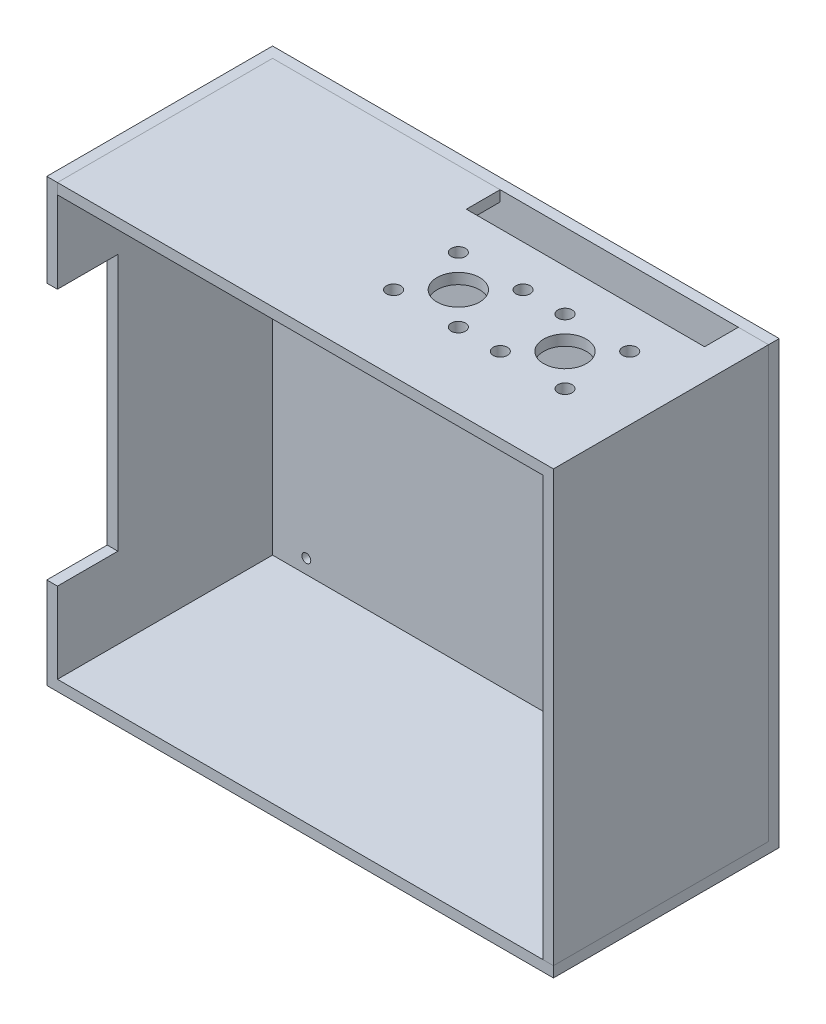
ISO-10303-21;
HEADER;
FILE_DESCRIPTION(('STEP AP214'),'2;1');
FILE_NAME('part.step','',(''),(''),'','','');
FILE_SCHEMA(('AUTOMOTIVE_DESIGN { 1 0 10303 214 1 1 1 1 }'));
ENDSEC;
DATA;
#1=APPLICATION_CONTEXT('core data for automotive mechanical design processes');
#2=APPLICATION_PROTOCOL_DEFINITION('international standard','automotive_design',2000,#1);
#3=PRODUCT_CONTEXT('',#1,'mechanical');
#4=PRODUCT('Part','Part','',(#3));
#5=PRODUCT_RELATED_PRODUCT_CATEGORY('part','',(#4));
#6=PRODUCT_DEFINITION_FORMATION('','',#4);
#7=PRODUCT_DEFINITION_CONTEXT('part definition',#1,'design');
#8=PRODUCT_DEFINITION('design','',#6,#7);
#9=PRODUCT_DEFINITION_SHAPE('','',#8);
#10=(LENGTH_UNIT() NAMED_UNIT(*) SI_UNIT(.MILLI.,.METRE.));
#11=(NAMED_UNIT(*) PLANE_ANGLE_UNIT() SI_UNIT($,.RADIAN.));
#12=(NAMED_UNIT(*) SI_UNIT($,.STERADIAN.) SOLID_ANGLE_UNIT());
#13=UNCERTAINTY_MEASURE_WITH_UNIT(LENGTH_MEASURE(1.E-05),#10,'distance_accuracy_value','');
#14=(GEOMETRIC_REPRESENTATION_CONTEXT(3) GLOBAL_UNCERTAINTY_ASSIGNED_CONTEXT((#13)) GLOBAL_UNIT_ASSIGNED_CONTEXT((#10,
#11,#12)) REPRESENTATION_CONTEXT('',''));
#15=CARTESIAN_POINT('',(0.,0.,0.));
#16=DIRECTION('',(0.,0.,1.));
#17=DIRECTION('',(1.,0.,0.));
#18=AXIS2_PLACEMENT_3D('',#15,#16,#17);
#19=CARTESIAN_POINT('',(68.25,0.,-28.75));
#20=DIRECTION('',(0.,0.,1.));
#21=DIRECTION('',(1.,0.,0.));
#22=AXIS2_PLACEMENT_3D('',#19,#20,#21);
#23=PLANE('',#22);
#24=DIRECTION('',(0.,-1.,0.));
#25=VECTOR('',#24,1.);
#26=CARTESIAN_POINT('',(71.25,0.,-28.75));
#27=LINE('',#26,#25);
#28=CARTESIAN_POINT('',(71.25,124.,-28.75));
#29=VERTEX_POINT('',#28);
#30=CARTESIAN_POINT('',(71.25,3.,-28.75));
#31=VERTEX_POINT('',#30);
#32=EDGE_CURVE('E134',#29,#31,#27,.T.);
#33=ORIENTED_EDGE('',*,*,#32,.T.);
#34=DIRECTION('',(1.,0.,0.));
#35=VECTOR('',#34,1.);
#36=CARTESIAN_POINT('',(68.25,3.,-28.75));
#37=LINE('',#36,#35);
#38=CARTESIAN_POINT('',(68.25,3.,-28.75));
#39=VERTEX_POINT('',#38);
#40=EDGE_CURVE('E12',#39,#31,#37,.T.);
#41=ORIENTED_EDGE('',*,*,#40,.F.);
#42=DIRECTION('',(0.,-1.,0.));
#43=VECTOR('',#42,1.);
#44=CARTESIAN_POINT('',(68.25,0.,-28.75));
#45=LINE('',#44,#43);
#46=CARTESIAN_POINT('',(68.25,121.,-28.75));
#47=VERTEX_POINT('',#46);
#48=EDGE_CURVE('E72',#47,#39,#45,.T.);
#49=ORIENTED_EDGE('',*,*,#48,.F.);
#50=DIRECTION('',(1.,0.,0.));
#51=VECTOR('',#50,1.);
#52=CARTESIAN_POINT('',(0.,121.,-28.75));
#53=LINE('',#52,#51);
#54=CARTESIAN_POINT('',(62.75,121.,-28.75));
#55=VERTEX_POINT('',#54);
#56=EDGE_CURVE('E99',#55,#47,#53,.T.);
#57=ORIENTED_EDGE('',*,*,#56,.F.);
#58=DIRECTION('',(0.,1.,0.));
#59=VECTOR('',#58,1.);
#60=CARTESIAN_POINT('',(62.75,121.,-28.75));
#61=LINE('',#60,#59);
#62=CARTESIAN_POINT('',(62.75,124.,-28.75));
#63=VERTEX_POINT('',#62);
#64=EDGE_CURVE('E205',#55,#63,#61,.T.);
#65=ORIENTED_EDGE('',*,*,#64,.T.);
#66=DIRECTION('',(1.,0.,0.));
#67=VECTOR('',#66,1.);
#68=CARTESIAN_POINT('',(0.,124.,-28.75));
#69=LINE('',#68,#67);
#70=EDGE_CURVE('E154',#63,#29,#69,.T.);
#71=ORIENTED_EDGE('',*,*,#70,.T.);
#72=EDGE_LOOP('',(#33,#41,#49,#57,#65,#71));
#73=FACE_BOUND('',#72,.T.);
#74=ADVANCED_FACE('F55',(#73),#23,.F.);
#75=CARTESIAN_POINT('',(68.25,3.,0.));
#76=DIRECTION('',(0.,-1.,0.));
#77=DIRECTION('',(0.,0.,-1.));
#78=AXIS2_PLACEMENT_3D('',#75,#76,#77);
#79=PLANE('',#78);
#80=DIRECTION('',(0.,0.,-1.));
#81=VECTOR('',#80,1.);
#82=CARTESIAN_POINT('',(71.25,3.,0.));
#83=LINE('',#82,#81);
#84=CARTESIAN_POINT('',(71.25,3.,31.75));
#85=VERTEX_POINT('',#84);
#86=EDGE_CURVE('E119',#85,#31,#83,.T.);
#87=ORIENTED_EDGE('',*,*,#86,.F.);
#88=DIRECTION('',(1.,0.,0.));
#89=VECTOR('',#88,1.);
#90=CARTESIAN_POINT('',(68.25,3.,31.75));
#91=LINE('',#90,#89);
#92=CARTESIAN_POINT('',(68.25,3.,31.75));
#93=VERTEX_POINT('',#92);
#94=EDGE_CURVE('E58',#93,#85,#91,.T.);
#95=ORIENTED_EDGE('',*,*,#94,.F.);
#96=DIRECTION('',(0.,0.,-1.));
#97=VECTOR('',#96,1.);
#98=CARTESIAN_POINT('',(68.25,3.,0.));
#99=LINE('',#98,#97);
#100=EDGE_CURVE('E131',#93,#39,#99,.T.);
#101=ORIENTED_EDGE('',*,*,#100,.T.);
#102=ORIENTED_EDGE('',*,*,#40,.T.);
#103=EDGE_LOOP('',(#87,#95,#101,#102));
#104=FACE_BOUND('',#103,.T.);
#105=ADVANCED_FACE('F150',(#104),#79,.T.);
#106=CARTESIAN_POINT('',(68.25,0.,31.75));
#107=DIRECTION('',(0.,0.,1.));
#108=DIRECTION('',(1.,0.,0.));
#109=AXIS2_PLACEMENT_3D('',#106,#107,#108);
#110=PLANE('',#109);
#111=DIRECTION('',(0.,-1.,0.));
#112=VECTOR('',#111,1.);
#113=CARTESIAN_POINT('',(71.25,0.,31.75));
#114=LINE('',#113,#112);
#115=CARTESIAN_POINT('',(71.25,124.,31.75));
#116=VERTEX_POINT('',#115);
#117=EDGE_CURVE('E123',#116,#85,#114,.T.);
#118=ORIENTED_EDGE('',*,*,#117,.F.);
#119=DIRECTION('',(1.,0.,0.));
#120=VECTOR('',#119,1.);
#121=CARTESIAN_POINT('',(0.,124.,31.75));
#122=LINE('',#121,#120);
#123=CARTESIAN_POINT('',(-68.25,124.,31.75));
#124=VERTEX_POINT('',#123);
#125=EDGE_CURVE('E231',#124,#116,#122,.T.);
#126=ORIENTED_EDGE('',*,*,#125,.F.);
#127=DIRECTION('',(0.,1.,0.));
#128=VECTOR('',#127,1.);
#129=CARTESIAN_POINT('',(-68.25,121.,31.75));
#130=LINE('',#129,#128);
#131=CARTESIAN_POINT('',(-68.25,121.,31.75));
#132=VERTEX_POINT('',#131);
#133=EDGE_CURVE('E137',#132,#124,#130,.T.);
#134=ORIENTED_EDGE('',*,*,#133,.F.);
#135=DIRECTION('',(1.,0.,0.));
#136=VECTOR('',#135,1.);
#137=CARTESIAN_POINT('',(0.,121.,31.75));
#138=LINE('',#137,#136);
#139=CARTESIAN_POINT('',(68.25,121.,31.75));
#140=VERTEX_POINT('',#139);
#141=EDGE_CURVE('E109',#132,#140,#138,.T.);
#142=ORIENTED_EDGE('',*,*,#141,.T.);
#143=DIRECTION('',(0.,-1.,0.));
#144=VECTOR('',#143,1.);
#145=CARTESIAN_POINT('',(68.25,0.,31.75));
#146=LINE('',#145,#144);
#147=EDGE_CURVE('E113',#140,#93,#146,.T.);
#148=ORIENTED_EDGE('',*,*,#147,.T.);
#149=ORIENTED_EDGE('',*,*,#94,.T.);
#150=EDGE_LOOP('',(#118,#126,#134,#142,#148,#149));
#151=FACE_BOUND('',#150,.T.);
#152=ADVANCED_FACE('F279',(#151),#110,.T.);
#153=CARTESIAN_POINT('',(68.25,0.,0.));
#154=DIRECTION('',(1.,0.,0.));
#155=DIRECTION('',(0.,0.,-1.));
#156=AXIS2_PLACEMENT_3D('',#153,#154,#155);
#157=PLANE('',#156);
#158=ORIENTED_EDGE('',*,*,#48,.T.);
#159=ORIENTED_EDGE('',*,*,#100,.F.);
#160=ORIENTED_EDGE('',*,*,#147,.F.);
#161=DIRECTION('',(0.,0.,-1.));
#162=VECTOR('',#161,1.);
#163=CARTESIAN_POINT('',(68.25,121.,0.));
#164=LINE('',#163,#162);
#165=EDGE_CURVE('E91',#140,#47,#164,.T.);
#166=ORIENTED_EDGE('',*,*,#165,.T.);
#167=EDGE_LOOP('',(#158,#159,#160,#166));
#168=FACE_BOUND('',#167,.T.);
#169=ADVANCED_FACE('F112',(#168),#157,.F.);
#170=CARTESIAN_POINT('',(71.25,0.,0.));
#171=DIRECTION('',(1.,0.,0.));
#172=DIRECTION('',(0.,0.,-1.));
#173=AXIS2_PLACEMENT_3D('',#170,#171,#172);
#174=PLANE('',#173);
#175=ORIENTED_EDGE('',*,*,#32,.F.);
#176=DIRECTION('',(0.,0.,-1.));
#177=VECTOR('',#176,1.);
#178=CARTESIAN_POINT('',(71.25,124.,0.));
#179=LINE('',#178,#177);
#180=EDGE_CURVE('E146',#116,#29,#179,.T.);
#181=ORIENTED_EDGE('',*,*,#180,.F.);
#182=ORIENTED_EDGE('',*,*,#117,.T.);
#183=ORIENTED_EDGE('',*,*,#86,.T.);
#184=EDGE_LOOP('',(#175,#181,#182,#183));
#185=FACE_BOUND('',#184,.T.);
#186=ADVANCED_FACE('F143',(#185),#174,.T.);
#187=CARTESIAN_POINT('',(0.,121.,-28.75));
#188=DIRECTION('',(0.,0.,1.));
#189=DIRECTION('',(1.,0.,0.));
#190=AXIS2_PLACEMENT_3D('',#187,#188,#189);
#191=PLANE('',#190);
#192=CARTESIAN_POINT('',(-68.25,124.,-28.75));
#193=VERTEX_POINT('',#192);
#194=CARTESIAN_POINT('',(-4.24999999999997,124.,-28.75));
#195=VERTEX_POINT('',#194);
#196=EDGE_CURVE('E247',#193,#195,#69,.T.);
#197=ORIENTED_EDGE('',*,*,#196,.T.);
#198=DIRECTION('',(0.,1.,0.));
#199=VECTOR('',#198,1.);
#200=CARTESIAN_POINT('',(-4.24999999999997,121.,-28.75));
#201=LINE('',#200,#199);
#202=CARTESIAN_POINT('',(-4.24999999999997,121.,-28.75));
#203=VERTEX_POINT('',#202);
#204=EDGE_CURVE('E232',#203,#195,#201,.T.);
#205=ORIENTED_EDGE('',*,*,#204,.F.);
#206=CARTESIAN_POINT('',(-68.25,121.,-28.75));
#207=VERTEX_POINT('',#206);
#208=EDGE_CURVE('E108',#207,#203,#53,.T.);
#209=ORIENTED_EDGE('',*,*,#208,.F.);
#210=DIRECTION('',(0.,1.,0.));
#211=VECTOR('',#210,1.);
#212=CARTESIAN_POINT('',(-68.25,121.,-28.75));
#213=LINE('',#212,#211);
#214=EDGE_CURVE('E126',#207,#193,#213,.T.);
#215=ORIENTED_EDGE('',*,*,#214,.T.);
#216=EDGE_LOOP('',(#197,#205,#209,#215));
#217=FACE_BOUND('',#216,.T.);
#218=ADVANCED_FACE('F258',(#217),#191,.F.);
#219=CARTESIAN_POINT('',(-68.25,121.,0.));
#220=DIRECTION('',(1.,0.,0.));
#221=DIRECTION('',(0.,0.,-1.));
#222=AXIS2_PLACEMENT_3D('',#219,#220,#221);
#223=PLANE('',#222);
#224=DIRECTION('',(0.,0.,-1.));
#225=VECTOR('',#224,1.);
#226=CARTESIAN_POINT('',(-68.25,124.,0.));
#227=LINE('',#226,#225);
#228=EDGE_CURVE('E238',#124,#193,#227,.T.);
#229=ORIENTED_EDGE('',*,*,#228,.T.);
#230=ORIENTED_EDGE('',*,*,#214,.F.);
#231=DIRECTION('',(0.,0.,-1.));
#232=VECTOR('',#231,1.);
#233=CARTESIAN_POINT('',(-68.25,121.,0.));
#234=LINE('',#233,#232);
#235=EDGE_CURVE('E172',#132,#207,#234,.T.);
#236=ORIENTED_EDGE('',*,*,#235,.F.);
#237=ORIENTED_EDGE('',*,*,#133,.T.);
#238=EDGE_LOOP('',(#229,#230,#236,#237));
#239=FACE_BOUND('',#238,.T.);
#240=ADVANCED_FACE('F291',(#239),#223,.F.);
#241=CARTESIAN_POINT('',(0.,121.,0.));
#242=DIRECTION('',(0.,1.,0.));
#243=DIRECTION('',(0.,0.,1.));
#244=AXIS2_PLACEMENT_3D('',#241,#242,#243);
#245=PLANE('',#244);
#246=CARTESIAN_POINT('',(23.35,121.,-7.6));
#247=DIRECTION('',(0.,1.,0.));
#248=DIRECTION('',(0.,0.,1.));
#249=AXIS2_PLACEMENT_3D('',#246,#247,#248);
#250=CIRCLE('',#249,2.00000000000001);
#251=CARTESIAN_POINT('',(23.35,121.,-5.59999999999999));
#252=VERTEX_POINT('',#251);
#253=EDGE_CURVE('E219',#252,#252,#250,.T.);
#254=ORIENTED_EDGE('',*,*,#253,.T.);
#255=EDGE_LOOP('',(#254));
#256=FACE_BOUND('',#255,.T.);
#257=CARTESIAN_POINT('',(5.15000000000003,121.,-7.6));
#258=DIRECTION('',(0.,1.,0.));
#259=DIRECTION('',(0.,0.,1.));
#260=AXIS2_PLACEMENT_3D('',#257,#258,#259);
#261=CIRCLE('',#260,2.);
#262=CARTESIAN_POINT('',(5.15000000000003,121.,-5.6));
#263=VERTEX_POINT('',#262);
#264=EDGE_CURVE('E307',#263,#263,#261,.T.);
#265=ORIENTED_EDGE('',*,*,#264,.T.);
#266=EDGE_LOOP('',(#265));
#267=FACE_BOUND('',#266,.T.);
#268=CARTESIAN_POINT('',(5.15000000000003,121.,10.6));
#269=DIRECTION('',(0.,1.,0.));
#270=DIRECTION('',(0.,0.,1.));
#271=AXIS2_PLACEMENT_3D('',#268,#269,#270);
#272=CIRCLE('',#271,2.);
#273=CARTESIAN_POINT('',(5.15000000000003,121.,12.6));
#274=VERTEX_POINT('',#273);
#275=EDGE_CURVE('E311',#274,#274,#272,.T.);
#276=ORIENTED_EDGE('',*,*,#275,.T.);
#277=EDGE_LOOP('',(#276));
#278=FACE_BOUND('',#277,.T.);
#279=CARTESIAN_POINT('',(23.35,121.,10.6));
#280=DIRECTION('',(0.,1.,0.));
#281=DIRECTION('',(0.,0.,1.));
#282=AXIS2_PLACEMENT_3D('',#279,#280,#281);
#283=CIRCLE('',#282,2.);
#284=CARTESIAN_POINT('',(23.35,121.,12.6));
#285=VERTEX_POINT('',#284);
#286=EDGE_CURVE('E315',#285,#285,#283,.T.);
#287=ORIENTED_EDGE('',*,*,#286,.T.);
#288=EDGE_LOOP('',(#287));
#289=FACE_BOUND('',#288,.T.);
#290=CARTESIAN_POINT('',(44.25,121.,1.5));
#291=DIRECTION('',(0.,1.,0.));
#292=DIRECTION('',(0.,0.,1.));
#293=AXIS2_PLACEMENT_3D('',#290,#291,#292);
#294=CIRCLE('',#293,6.);
#295=CARTESIAN_POINT('',(44.25,121.,7.5));
#296=VERTEX_POINT('',#295);
#297=EDGE_CURVE('E319',#296,#296,#294,.T.);
#298=ORIENTED_EDGE('',*,*,#297,.T.);
#299=EDGE_LOOP('',(#298));
#300=FACE_BOUND('',#299,.T.);
#301=CARTESIAN_POINT('',(53.35,121.,-7.6));
#302=DIRECTION('',(0.,1.,0.));
#303=DIRECTION('',(0.,0.,1.));
#304=AXIS2_PLACEMENT_3D('',#301,#302,#303);
#305=CIRCLE('',#304,2.);
#306=CARTESIAN_POINT('',(53.35,121.,-5.59999999999999));
#307=VERTEX_POINT('',#306);
#308=EDGE_CURVE('E323',#307,#307,#305,.T.);
#309=ORIENTED_EDGE('',*,*,#308,.T.);
#310=EDGE_LOOP('',(#309));
#311=FACE_BOUND('',#310,.T.);
#312=CARTESIAN_POINT('',(35.15,121.,-7.6));
#313=DIRECTION('',(0.,1.,0.));
#314=DIRECTION('',(0.,0.,1.));
#315=AXIS2_PLACEMENT_3D('',#312,#313,#314);
#316=CIRCLE('',#315,2.);
#317=CARTESIAN_POINT('',(35.15,121.,-5.59999999999999));
#318=VERTEX_POINT('',#317);
#319=EDGE_CURVE('E327',#318,#318,#316,.T.);
#320=ORIENTED_EDGE('',*,*,#319,.T.);
#321=EDGE_LOOP('',(#320));
#322=FACE_BOUND('',#321,.T.);
#323=CARTESIAN_POINT('',(35.15,121.,10.6));
#324=DIRECTION('',(0.,1.,0.));
#325=DIRECTION('',(0.,0.,1.));
#326=AXIS2_PLACEMENT_3D('',#323,#324,#325);
#327=CIRCLE('',#326,2.);
#328=CARTESIAN_POINT('',(35.15,121.,12.6));
#329=VERTEX_POINT('',#328);
#330=EDGE_CURVE('E331',#329,#329,#327,.T.);
#331=ORIENTED_EDGE('',*,*,#330,.T.);
#332=EDGE_LOOP('',(#331));
#333=FACE_BOUND('',#332,.T.);
#334=CARTESIAN_POINT('',(53.35,121.,10.6));
#335=DIRECTION('',(0.,1.,0.));
#336=DIRECTION('',(0.,0.,1.));
#337=AXIS2_PLACEMENT_3D('',#334,#335,#336);
#338=CIRCLE('',#337,2.);
#339=CARTESIAN_POINT('',(53.35,121.,12.6));
#340=VERTEX_POINT('',#339);
#341=EDGE_CURVE('E335',#340,#340,#338,.T.);
#342=ORIENTED_EDGE('',*,*,#341,.T.);
#343=EDGE_LOOP('',(#342));
#344=FACE_BOUND('',#343,.T.);
#345=CARTESIAN_POINT('',(14.25,121.,1.5));
#346=DIRECTION('',(0.,1.,0.));
#347=DIRECTION('',(0.,0.,1.));
#348=AXIS2_PLACEMENT_3D('',#345,#346,#347);
#349=CIRCLE('',#348,6.);
#350=CARTESIAN_POINT('',(14.25,121.,7.5));
#351=VERTEX_POINT('',#350);
#352=EDGE_CURVE('E338',#351,#351,#349,.T.);
#353=ORIENTED_EDGE('',*,*,#352,.T.);
#354=EDGE_LOOP('',(#353));
#355=FACE_BOUND('',#354,.T.);
#356=ORIENTED_EDGE('',*,*,#165,.F.);
#357=ORIENTED_EDGE('',*,*,#141,.F.);
#358=ORIENTED_EDGE('',*,*,#235,.T.);
#359=ORIENTED_EDGE('',*,*,#208,.T.);
#360=DIRECTION('',(0.,0.,1.));
#361=VECTOR('',#360,1.);
#362=CARTESIAN_POINT('',(-4.24999999999997,121.,0.));
#363=LINE('',#362,#361);
#364=CARTESIAN_POINT('',(-4.24999999999997,121.,-19.25));
#365=VERTEX_POINT('',#364);
#366=EDGE_CURVE('E206',#203,#365,#363,.T.);
#367=ORIENTED_EDGE('',*,*,#366,.T.);
#368=DIRECTION('',(1.,0.,0.));
#369=VECTOR('',#368,1.);
#370=CARTESIAN_POINT('',(0.,121.,-19.25));
#371=LINE('',#370,#369);
#372=CARTESIAN_POINT('',(62.75,121.,-19.25));
#373=VERTEX_POINT('',#372);
#374=EDGE_CURVE('E198',#365,#373,#371,.T.);
#375=ORIENTED_EDGE('',*,*,#374,.T.);
#376=DIRECTION('',(0.,0.,-1.));
#377=VECTOR('',#376,1.);
#378=CARTESIAN_POINT('',(62.75,121.,0.));
#379=LINE('',#378,#377);
#380=EDGE_CURVE('E104',#373,#55,#379,.T.);
#381=ORIENTED_EDGE('',*,*,#380,.T.);
#382=ORIENTED_EDGE('',*,*,#56,.T.);
#383=EDGE_LOOP('',(#356,#357,#358,#359,#367,#375,#381,#382));
#384=FACE_BOUND('',#383,.T.);
#385=ADVANCED_FACE('F100',(#256,#267,#278,#289,#300,#311,#322,#333,#344,#355,#384),#245,.F.);
#386=CARTESIAN_POINT('',(0.,124.,0.));
#387=DIRECTION('',(0.,1.,0.));
#388=DIRECTION('',(0.,0.,1.));
#389=AXIS2_PLACEMENT_3D('',#386,#387,#388);
#390=PLANE('',#389);
#391=CARTESIAN_POINT('',(23.35,124.,-7.6));
#392=DIRECTION('',(0.,1.,0.));
#393=DIRECTION('',(0.,0.,1.));
#394=AXIS2_PLACEMENT_3D('',#391,#392,#393);
#395=CIRCLE('',#394,2.00000000000001);
#396=CARTESIAN_POINT('',(23.35,124.,-5.59999999999999));
#397=VERTEX_POINT('',#396);
#398=EDGE_CURVE('E347',#397,#397,#395,.T.);
#399=ORIENTED_EDGE('',*,*,#398,.F.);
#400=EDGE_LOOP('',(#399));
#401=FACE_BOUND('',#400,.T.);
#402=CARTESIAN_POINT('',(5.15000000000003,124.,-7.6));
#403=DIRECTION('',(0.,1.,0.));
#404=DIRECTION('',(0.,0.,1.));
#405=AXIS2_PLACEMENT_3D('',#402,#403,#404);
#406=CIRCLE('',#405,2.);
#407=CARTESIAN_POINT('',(5.15000000000003,124.,-5.6));
#408=VERTEX_POINT('',#407);
#409=EDGE_CURVE('E389',#408,#408,#406,.T.);
#410=ORIENTED_EDGE('',*,*,#409,.F.);
#411=EDGE_LOOP('',(#410));
#412=FACE_BOUND('',#411,.T.);
#413=CARTESIAN_POINT('',(5.15000000000003,124.,10.6));
#414=DIRECTION('',(0.,1.,0.));
#415=DIRECTION('',(0.,0.,1.));
#416=AXIS2_PLACEMENT_3D('',#413,#414,#415);
#417=CIRCLE('',#416,2.);
#418=CARTESIAN_POINT('',(5.15000000000003,124.,12.6));
#419=VERTEX_POINT('',#418);
#420=EDGE_CURVE('E385',#419,#419,#417,.T.);
#421=ORIENTED_EDGE('',*,*,#420,.F.);
#422=EDGE_LOOP('',(#421));
#423=FACE_BOUND('',#422,.T.);
#424=CARTESIAN_POINT('',(23.35,124.,10.6));
#425=DIRECTION('',(0.,1.,0.));
#426=DIRECTION('',(0.,0.,1.));
#427=AXIS2_PLACEMENT_3D('',#424,#425,#426);
#428=CIRCLE('',#427,2.);
#429=CARTESIAN_POINT('',(23.35,124.,12.6));
#430=VERTEX_POINT('',#429);
#431=EDGE_CURVE('E381',#430,#430,#428,.T.);
#432=ORIENTED_EDGE('',*,*,#431,.F.);
#433=EDGE_LOOP('',(#432));
#434=FACE_BOUND('',#433,.T.);
#435=CARTESIAN_POINT('',(44.25,124.,1.5));
#436=DIRECTION('',(0.,1.,0.));
#437=DIRECTION('',(0.,0.,1.));
#438=AXIS2_PLACEMENT_3D('',#435,#436,#437);
#439=CIRCLE('',#438,6.);
#440=CARTESIAN_POINT('',(44.25,124.,7.5));
#441=VERTEX_POINT('',#440);
#442=EDGE_CURVE('E377',#441,#441,#439,.T.);
#443=ORIENTED_EDGE('',*,*,#442,.F.);
#444=EDGE_LOOP('',(#443));
#445=FACE_BOUND('',#444,.T.);
#446=CARTESIAN_POINT('',(53.35,124.,-7.6));
#447=DIRECTION('',(0.,1.,0.));
#448=DIRECTION('',(0.,0.,1.));
#449=AXIS2_PLACEMENT_3D('',#446,#447,#448);
#450=CIRCLE('',#449,2.);
#451=CARTESIAN_POINT('',(53.35,124.,-5.59999999999999));
#452=VERTEX_POINT('',#451);
#453=EDGE_CURVE('E373',#452,#452,#450,.T.);
#454=ORIENTED_EDGE('',*,*,#453,.F.);
#455=EDGE_LOOP('',(#454));
#456=FACE_BOUND('',#455,.T.);
#457=CARTESIAN_POINT('',(35.15,124.,-7.6));
#458=DIRECTION('',(0.,1.,0.));
#459=DIRECTION('',(0.,0.,1.));
#460=AXIS2_PLACEMENT_3D('',#457,#458,#459);
#461=CIRCLE('',#460,2.);
#462=CARTESIAN_POINT('',(35.15,124.,-5.59999999999999));
#463=VERTEX_POINT('',#462);
#464=EDGE_CURVE('E368',#463,#463,#461,.T.);
#465=ORIENTED_EDGE('',*,*,#464,.F.);
#466=EDGE_LOOP('',(#465));
#467=FACE_BOUND('',#466,.T.);
#468=CARTESIAN_POINT('',(35.15,124.,10.6));
#469=DIRECTION('',(0.,1.,0.));
#470=DIRECTION('',(0.,0.,1.));
#471=AXIS2_PLACEMENT_3D('',#468,#469,#470);
#472=CIRCLE('',#471,2.);
#473=CARTESIAN_POINT('',(35.15,124.,12.6));
#474=VERTEX_POINT('',#473);
#475=EDGE_CURVE('E364',#474,#474,#472,.T.);
#476=ORIENTED_EDGE('',*,*,#475,.F.);
#477=EDGE_LOOP('',(#476));
#478=FACE_BOUND('',#477,.T.);
#479=CARTESIAN_POINT('',(53.35,124.,10.6));
#480=DIRECTION('',(0.,1.,0.));
#481=DIRECTION('',(0.,0.,1.));
#482=AXIS2_PLACEMENT_3D('',#479,#480,#481);
#483=CIRCLE('',#482,2.);
#484=CARTESIAN_POINT('',(53.35,124.,12.6));
#485=VERTEX_POINT('',#484);
#486=EDGE_CURVE('E369',#485,#485,#483,.T.);
#487=ORIENTED_EDGE('',*,*,#486,.F.);
#488=EDGE_LOOP('',(#487));
#489=FACE_BOUND('',#488,.T.);
#490=CARTESIAN_POINT('',(14.25,124.,1.5));
#491=DIRECTION('',(0.,1.,0.));
#492=DIRECTION('',(0.,0.,1.));
#493=AXIS2_PLACEMENT_3D('',#490,#491,#492);
#494=CIRCLE('',#493,6.);
#495=CARTESIAN_POINT('',(14.25,124.,7.5));
#496=VERTEX_POINT('',#495);
#497=EDGE_CURVE('E341',#496,#496,#494,.T.);
#498=ORIENTED_EDGE('',*,*,#497,.F.);
#499=EDGE_LOOP('',(#498));
#500=FACE_BOUND('',#499,.T.);
#501=DIRECTION('',(0.,0.,1.));
#502=VECTOR('',#501,1.);
#503=CARTESIAN_POINT('',(-4.24999999999997,124.,0.));
#504=LINE('',#503,#502);
#505=CARTESIAN_POINT('',(-4.24999999999997,124.,-19.25));
#506=VERTEX_POINT('',#505);
#507=EDGE_CURVE('E212',#195,#506,#504,.T.);
#508=ORIENTED_EDGE('',*,*,#507,.F.);
#509=ORIENTED_EDGE('',*,*,#196,.F.);
#510=ORIENTED_EDGE('',*,*,#228,.F.);
#511=ORIENTED_EDGE('',*,*,#125,.T.);
#512=ORIENTED_EDGE('',*,*,#180,.T.);
#513=ORIENTED_EDGE('',*,*,#70,.F.);
#514=DIRECTION('',(0.,0.,-1.));
#515=VECTOR('',#514,1.);
#516=CARTESIAN_POINT('',(62.75,124.,0.));
#517=LINE('',#516,#515);
#518=CARTESIAN_POINT('',(62.75,124.,-19.25));
#519=VERTEX_POINT('',#518);
#520=EDGE_CURVE('E216',#519,#63,#517,.T.);
#521=ORIENTED_EDGE('',*,*,#520,.F.);
#522=DIRECTION('',(1.,0.,0.));
#523=VECTOR('',#522,1.);
#524=CARTESIAN_POINT('',(0.,124.,-19.25));
#525=LINE('',#524,#523);
#526=EDGE_CURVE('E201',#506,#519,#525,.T.);
#527=ORIENTED_EDGE('',*,*,#526,.F.);
#528=EDGE_LOOP('',(#508,#509,#510,#511,#512,#513,#521,#527));
#529=FACE_BOUND('',#528,.T.);
#530=ADVANCED_FACE('F262',(#401,#412,#423,#434,#445,#456,#467,#478,#489,#500,#529),#390,.T.);
#531=CARTESIAN_POINT('',(0.,121.,-19.25));
#532=DIRECTION('',(0.,0.,1.));
#533=DIRECTION('',(1.,0.,0.));
#534=AXIS2_PLACEMENT_3D('',#531,#532,#533);
#535=PLANE('',#534);
#536=ORIENTED_EDGE('',*,*,#526,.T.);
#537=DIRECTION('',(0.,1.,0.));
#538=VECTOR('',#537,1.);
#539=CARTESIAN_POINT('',(62.75,121.,-19.25));
#540=LINE('',#539,#538);
#541=EDGE_CURVE('E196',#373,#519,#540,.T.);
#542=ORIENTED_EDGE('',*,*,#541,.F.);
#543=ORIENTED_EDGE('',*,*,#374,.F.);
#544=DIRECTION('',(0.,1.,0.));
#545=VECTOR('',#544,1.);
#546=CARTESIAN_POINT('',(-4.24999999999997,121.,-19.25));
#547=LINE('',#546,#545);
#548=EDGE_CURVE('E228',#365,#506,#547,.T.);
#549=ORIENTED_EDGE('',*,*,#548,.T.);
#550=EDGE_LOOP('',(#536,#542,#543,#549));
#551=FACE_BOUND('',#550,.T.);
#552=ADVANCED_FACE('F197',(#551),#535,.F.);
#553=CARTESIAN_POINT('',(-4.24999999999997,121.,0.));
#554=DIRECTION('',(-1.,0.,0.));
#555=DIRECTION('',(0.,0.,1.));
#556=AXIS2_PLACEMENT_3D('',#553,#554,#555);
#557=PLANE('',#556);
#558=ORIENTED_EDGE('',*,*,#507,.T.);
#559=ORIENTED_EDGE('',*,*,#548,.F.);
#560=ORIENTED_EDGE('',*,*,#366,.F.);
#561=ORIENTED_EDGE('',*,*,#204,.T.);
#562=EDGE_LOOP('',(#558,#559,#560,#561));
#563=FACE_BOUND('',#562,.T.);
#564=ADVANCED_FACE('F264',(#563),#557,.F.);
#565=CARTESIAN_POINT('',(62.75,121.,0.));
#566=DIRECTION('',(1.,0.,0.));
#567=DIRECTION('',(0.,0.,-1.));
#568=AXIS2_PLACEMENT_3D('',#565,#566,#567);
#569=PLANE('',#568);
#570=ORIENTED_EDGE('',*,*,#520,.T.);
#571=ORIENTED_EDGE('',*,*,#64,.F.);
#572=ORIENTED_EDGE('',*,*,#380,.F.);
#573=ORIENTED_EDGE('',*,*,#541,.T.);
#574=EDGE_LOOP('',(#570,#571,#572,#573));
#575=FACE_BOUND('',#574,.T.);
#576=ADVANCED_FACE('F208',(#575),#569,.F.);
#577=CARTESIAN_POINT('',(14.25,114.,1.5));
#578=DIRECTION('',(0.,1.,0.));
#579=DIRECTION('',(0.,0.,1.));
#580=AXIS2_PLACEMENT_3D('',#577,#578,#579);
#581=CYLINDRICAL_SURFACE('',#580,6.);
#582=ORIENTED_EDGE('',*,*,#497,.T.);
#583=EDGE_LOOP('',(#582));
#584=FACE_BOUND('',#583,.T.);
#585=ORIENTED_EDGE('',*,*,#352,.F.);
#586=EDGE_LOOP('',(#585));
#587=FACE_BOUND('',#586,.T.);
#588=ADVANCED_FACE('F271',(#584,#587),#581,.F.);
#589=CARTESIAN_POINT('',(53.35,114.,10.6));
#590=DIRECTION('',(0.,1.,0.));
#591=DIRECTION('',(0.,0.,1.));
#592=AXIS2_PLACEMENT_3D('',#589,#590,#591);
#593=CYLINDRICAL_SURFACE('',#592,2.);
#594=ORIENTED_EDGE('',*,*,#486,.T.);
#595=EDGE_LOOP('',(#594));
#596=FACE_BOUND('',#595,.T.);
#597=ORIENTED_EDGE('',*,*,#341,.F.);
#598=EDGE_LOOP('',(#597));
#599=FACE_BOUND('',#598,.T.);
#600=ADVANCED_FACE('F400',(#596,#599),#593,.F.);
#601=CARTESIAN_POINT('',(35.15,114.,10.6));
#602=DIRECTION('',(0.,1.,0.));
#603=DIRECTION('',(0.,0.,1.));
#604=AXIS2_PLACEMENT_3D('',#601,#602,#603);
#605=CYLINDRICAL_SURFACE('',#604,2.);
#606=ORIENTED_EDGE('',*,*,#475,.T.);
#607=EDGE_LOOP('',(#606));
#608=FACE_BOUND('',#607,.T.);
#609=ORIENTED_EDGE('',*,*,#330,.F.);
#610=EDGE_LOOP('',(#609));
#611=FACE_BOUND('',#610,.T.);
#612=ADVANCED_FACE('F410',(#608,#611),#605,.F.);
#613=CARTESIAN_POINT('',(35.15,114.,-7.6));
#614=DIRECTION('',(0.,1.,0.));
#615=DIRECTION('',(0.,0.,1.));
#616=AXIS2_PLACEMENT_3D('',#613,#614,#615);
#617=CYLINDRICAL_SURFACE('',#616,2.);
#618=ORIENTED_EDGE('',*,*,#464,.T.);
#619=EDGE_LOOP('',(#618));
#620=FACE_BOUND('',#619,.T.);
#621=ORIENTED_EDGE('',*,*,#319,.F.);
#622=EDGE_LOOP('',(#621));
#623=FACE_BOUND('',#622,.T.);
#624=ADVANCED_FACE('F415',(#620,#623),#617,.F.);
#625=CARTESIAN_POINT('',(53.35,114.,-7.6));
#626=DIRECTION('',(0.,1.,0.));
#627=DIRECTION('',(0.,0.,1.));
#628=AXIS2_PLACEMENT_3D('',#625,#626,#627);
#629=CYLINDRICAL_SURFACE('',#628,2.);
#630=ORIENTED_EDGE('',*,*,#453,.T.);
#631=EDGE_LOOP('',(#630));
#632=FACE_BOUND('',#631,.T.);
#633=ORIENTED_EDGE('',*,*,#308,.F.);
#634=EDGE_LOOP('',(#633));
#635=FACE_BOUND('',#634,.T.);
#636=ADVANCED_FACE('F419',(#632,#635),#629,.F.);
#637=CARTESIAN_POINT('',(44.25,114.,1.5));
#638=DIRECTION('',(0.,1.,0.));
#639=DIRECTION('',(0.,0.,1.));
#640=AXIS2_PLACEMENT_3D('',#637,#638,#639);
#641=CYLINDRICAL_SURFACE('',#640,6.);
#642=ORIENTED_EDGE('',*,*,#442,.T.);
#643=EDGE_LOOP('',(#642));
#644=FACE_BOUND('',#643,.T.);
#645=ORIENTED_EDGE('',*,*,#297,.F.);
#646=EDGE_LOOP('',(#645));
#647=FACE_BOUND('',#646,.T.);
#648=ADVANCED_FACE('F423',(#644,#647),#641,.F.);
#649=CARTESIAN_POINT('',(23.35,114.,10.6));
#650=DIRECTION('',(0.,1.,0.));
#651=DIRECTION('',(0.,0.,1.));
#652=AXIS2_PLACEMENT_3D('',#649,#650,#651);
#653=CYLINDRICAL_SURFACE('',#652,2.);
#654=ORIENTED_EDGE('',*,*,#431,.T.);
#655=EDGE_LOOP('',(#654));
#656=FACE_BOUND('',#655,.T.);
#657=ORIENTED_EDGE('',*,*,#286,.F.);
#658=EDGE_LOOP('',(#657));
#659=FACE_BOUND('',#658,.T.);
#660=ADVANCED_FACE('F427',(#656,#659),#653,.F.);
#661=CARTESIAN_POINT('',(5.15000000000003,114.,10.6));
#662=DIRECTION('',(0.,1.,0.));
#663=DIRECTION('',(0.,0.,1.));
#664=AXIS2_PLACEMENT_3D('',#661,#662,#663);
#665=CYLINDRICAL_SURFACE('',#664,2.);
#666=ORIENTED_EDGE('',*,*,#420,.T.);
#667=EDGE_LOOP('',(#666));
#668=FACE_BOUND('',#667,.T.);
#669=ORIENTED_EDGE('',*,*,#275,.F.);
#670=EDGE_LOOP('',(#669));
#671=FACE_BOUND('',#670,.T.);
#672=ADVANCED_FACE('F431',(#668,#671),#665,.F.);
#673=CARTESIAN_POINT('',(5.15000000000003,114.,-7.6));
#674=DIRECTION('',(0.,1.,0.));
#675=DIRECTION('',(0.,0.,1.));
#676=AXIS2_PLACEMENT_3D('',#673,#674,#675);
#677=CYLINDRICAL_SURFACE('',#676,2.);
#678=ORIENTED_EDGE('',*,*,#409,.T.);
#679=EDGE_LOOP('',(#678));
#680=FACE_BOUND('',#679,.T.);
#681=ORIENTED_EDGE('',*,*,#264,.F.);
#682=EDGE_LOOP('',(#681));
#683=FACE_BOUND('',#682,.T.);
#684=ADVANCED_FACE('F435',(#680,#683),#677,.F.);
#685=CARTESIAN_POINT('',(23.35,114.,-7.6));
#686=DIRECTION('',(0.,1.,0.));
#687=DIRECTION('',(0.,0.,1.));
#688=AXIS2_PLACEMENT_3D('',#685,#686,#687);
#689=CYLINDRICAL_SURFACE('',#688,2.00000000000001);
#690=ORIENTED_EDGE('',*,*,#398,.T.);
#691=EDGE_LOOP('',(#690));
#692=FACE_BOUND('',#691,.T.);
#693=ORIENTED_EDGE('',*,*,#253,.F.);
#694=EDGE_LOOP('',(#693));
#695=FACE_BOUND('',#694,.T.);
#696=ADVANCED_FACE('F439',(#692,#695),#689,.F.);
#697=CLOSED_SHELL('',(#74,#105,#152,#169,#186,#218,#240,#385,#530,#552,#564,#576,#588,#600,#612,
#624,#636,#648,#660,#672,#684,#696));
#698=MANIFOLD_SOLID_BREP('B2',#697);
#699=CARTESIAN_POINT('',(0.,124.,31.75));
#700=DIRECTION('',(0.,0.,-1.));
#701=DIRECTION('',(-1.,0.,0.));
#702=AXIS2_PLACEMENT_3D('',#699,#700,#701);
#703=PLANE('',#702);
#704=DIRECTION('',(0.,-1.,0.));
#705=VECTOR('',#704,1.);
#706=CARTESIAN_POINT('',(-71.25,124.,31.75));
#707=LINE('',#706,#705);
#708=CARTESIAN_POINT('',(-71.25,124.,31.75));
#709=VERTEX_POINT('',#708);
#710=CARTESIAN_POINT('',(-71.25,98.,31.75));
#711=VERTEX_POINT('',#710);
#712=EDGE_CURVE('E698',#709,#711,#707,.T.);
#713=ORIENTED_EDGE('',*,*,#712,.T.);
#714=DIRECTION('',(-1.,0.,0.));
#715=VECTOR('',#714,1.);
#716=CARTESIAN_POINT('',(-68.25,98.,31.75));
#717=LINE('',#716,#715);
#718=CARTESIAN_POINT('',(-68.25,98.,31.75));
#719=VERTEX_POINT('',#718);
#720=EDGE_CURVE('E804',#719,#711,#717,.T.);
#721=ORIENTED_EDGE('',*,*,#720,.F.);
#722=DIRECTION('',(0.,-1.,0.));
#723=VECTOR('',#722,1.);
#724=CARTESIAN_POINT('',(-68.25,124.,31.75));
#725=LINE('',#724,#723);
#726=CARTESIAN_POINT('',(-68.25,124.,31.75));
#727=VERTEX_POINT('',#726);
#728=EDGE_CURVE('E714',#727,#719,#725,.T.);
#729=ORIENTED_EDGE('',*,*,#728,.F.);
#730=DIRECTION('',(1.,0.,0.));
#731=VECTOR('',#730,1.);
#732=CARTESIAN_POINT('',(0.,124.,31.75));
#733=LINE('',#732,#731);
#734=EDGE_CURVE('E712',#709,#727,#733,.T.);
#735=ORIENTED_EDGE('',*,*,#734,.F.);
#736=EDGE_LOOP('',(#713,#721,#729,#735));
#737=FACE_BOUND('',#736,.T.);
#738=ADVANCED_FACE('F634',(#737),#703,.F.);
#739=CARTESIAN_POINT('',(0.,124.,-28.75));
#740=DIRECTION('',(0.,0.,-1.));
#741=DIRECTION('',(-1.,0.,0.));
#742=AXIS2_PLACEMENT_3D('',#739,#740,#741);
#743=PLANE('',#742);
#744=CARTESIAN_POINT('',(58.75,7.00000000000001,-28.75));
#745=DIRECTION('',(0.,0.,-1.));
#746=DIRECTION('',(-1.,0.,0.));
#747=AXIS2_PLACEMENT_3D('',#744,#745,#746);
#748=CIRCLE('',#747,1.25);
#749=CARTESIAN_POINT('',(57.5,7.00000000000001,-28.75));
#750=VERTEX_POINT('',#749);
#751=EDGE_CURVE('E823',#750,#750,#748,.T.);
#752=ORIENTED_EDGE('',*,*,#751,.T.);
#753=EDGE_LOOP('',(#752));
#754=FACE_BOUND('',#753,.T.);
#755=CARTESIAN_POINT('',(-58.75,7.00000000000001,-28.75));
#756=DIRECTION('',(0.,0.,-1.));
#757=DIRECTION('',(-1.,0.,0.));
#758=AXIS2_PLACEMENT_3D('',#755,#756,#757);
#759=CIRCLE('',#758,1.25);
#760=CARTESIAN_POINT('',(-60.,7.00000000000001,-28.75));
#761=VERTEX_POINT('',#760);
#762=EDGE_CURVE('E831',#761,#761,#759,.T.);
#763=ORIENTED_EDGE('',*,*,#762,.T.);
#764=EDGE_LOOP('',(#763));
#765=FACE_BOUND('',#764,.T.);
#766=CARTESIAN_POINT('',(-58.75,117.,-28.75));
#767=DIRECTION('',(0.,0.,-1.));
#768=DIRECTION('',(-1.,0.,0.));
#769=AXIS2_PLACEMENT_3D('',#766,#767,#768);
#770=CIRCLE('',#769,1.25);
#771=CARTESIAN_POINT('',(-60.,117.,-28.75));
#772=VERTEX_POINT('',#771);
#773=EDGE_CURVE('E815',#772,#772,#770,.T.);
#774=ORIENTED_EDGE('',*,*,#773,.T.);
#775=EDGE_LOOP('',(#774));
#776=FACE_BOUND('',#775,.T.);
#777=CARTESIAN_POINT('',(58.75,117.,-28.75));
#778=DIRECTION('',(0.,0.,-1.));
#779=DIRECTION('',(-1.,0.,0.));
#780=AXIS2_PLACEMENT_3D('',#777,#778,#779);
#781=CIRCLE('',#780,1.25);
#782=CARTESIAN_POINT('',(57.5,117.,-28.75));
#783=VERTEX_POINT('',#782);
#784=EDGE_CURVE('E819',#783,#783,#781,.T.);
#785=ORIENTED_EDGE('',*,*,#784,.T.);
#786=EDGE_LOOP('',(#785));
#787=FACE_BOUND('',#786,.T.);
#788=DIRECTION('',(-1.,0.,0.));
#789=VECTOR('',#788,1.);
#790=CARTESIAN_POINT('',(0.,3.,-28.75));
#791=LINE('',#790,#789);
#792=CARTESIAN_POINT('',(71.25,3.,-28.75));
#793=VERTEX_POINT('',#792);
#794=CARTESIAN_POINT('',(-68.25,3.,-28.75));
#795=VERTEX_POINT('',#794);
#796=EDGE_CURVE('E732',#793,#795,#791,.T.);
#797=ORIENTED_EDGE('',*,*,#796,.F.);
#798=DIRECTION('',(0.,-1.,0.));
#799=VECTOR('',#798,1.);
#800=CARTESIAN_POINT('',(71.25,124.,-28.75));
#801=LINE('',#800,#799);
#802=CARTESIAN_POINT('',(71.25,124.,-28.75));
#803=VERTEX_POINT('',#802);
#804=EDGE_CURVE('E642',#803,#793,#801,.T.);
#805=ORIENTED_EDGE('',*,*,#804,.F.);
#806=DIRECTION('',(1.,0.,0.));
#807=VECTOR('',#806,1.);
#808=CARTESIAN_POINT('',(0.,124.,-28.75));
#809=LINE('',#808,#807);
#810=CARTESIAN_POINT('',(-68.25,124.,-28.75));
#811=VERTEX_POINT('',#810);
#812=EDGE_CURVE('E740',#811,#803,#809,.T.);
#813=ORIENTED_EDGE('',*,*,#812,.F.);
#814=DIRECTION('',(0.,-1.,0.));
#815=VECTOR('',#814,1.);
#816=CARTESIAN_POINT('',(-68.25,124.,-28.75));
#817=LINE('',#816,#815);
#818=EDGE_CURVE('E657',#811,#795,#817,.T.);
#819=ORIENTED_EDGE('',*,*,#818,.T.);
#820=EDGE_LOOP('',(#797,#805,#813,#819));
#821=FACE_BOUND('',#820,.T.);
#822=ADVANCED_FACE('F636',(#754,#765,#776,#787,#821),#743,.F.);
#823=CARTESIAN_POINT('',(-68.25,124.,0.));
#824=DIRECTION('',(1.,0.,0.));
#825=DIRECTION('',(0.,0.,-1.));
#826=AXIS2_PLACEMENT_3D('',#823,#824,#825);
#827=PLANE('',#826);
#828=DIRECTION('',(0.,0.,-1.));
#829=VECTOR('',#828,1.);
#830=CARTESIAN_POINT('',(-68.25,98.,0.));
#831=LINE('',#830,#829);
#832=CARTESIAN_POINT('',(-68.25,98.,14.75));
#833=VERTEX_POINT('',#832);
#834=EDGE_CURVE('E802',#719,#833,#831,.T.);
#835=ORIENTED_EDGE('',*,*,#834,.T.);
#836=DIRECTION('',(0.,-1.,0.));
#837=VECTOR('',#836,1.);
#838=CARTESIAN_POINT('',(-68.25,0.,14.75));
#839=LINE('',#838,#837);
#840=CARTESIAN_POINT('',(-68.25,25.7,14.75));
#841=VERTEX_POINT('',#840);
#842=EDGE_CURVE('E810',#833,#841,#839,.T.);
#843=ORIENTED_EDGE('',*,*,#842,.T.);
#844=DIRECTION('',(0.,0.,1.));
#845=VECTOR('',#844,1.);
#846=CARTESIAN_POINT('',(-68.25,25.7,0.));
#847=LINE('',#846,#845);
#848=CARTESIAN_POINT('',(-68.25,25.7,31.75));
#849=VERTEX_POINT('',#848);
#850=EDGE_CURVE('E794',#841,#849,#847,.T.);
#851=ORIENTED_EDGE('',*,*,#850,.T.);
#852=CARTESIAN_POINT('',(-68.25,3.,31.75));
#853=VERTEX_POINT('',#852);
#854=EDGE_CURVE('E742',#849,#853,#725,.T.);
#855=ORIENTED_EDGE('',*,*,#854,.T.);
#856=DIRECTION('',(0.,0.,-1.));
#857=VECTOR('',#856,1.);
#858=CARTESIAN_POINT('',(-68.25,3.,0.));
#859=LINE('',#858,#857);
#860=EDGE_CURVE('E53',#853,#795,#859,.T.);
#861=ORIENTED_EDGE('',*,*,#860,.T.);
#862=ORIENTED_EDGE('',*,*,#818,.F.);
#863=DIRECTION('',(0.,0.,1.));
#864=VECTOR('',#863,1.);
#865=CARTESIAN_POINT('',(-68.25,124.,0.));
#866=LINE('',#865,#864);
#867=EDGE_CURVE('E717',#811,#727,#866,.T.);
#868=ORIENTED_EDGE('',*,*,#867,.T.);
#869=ORIENTED_EDGE('',*,*,#728,.T.);
#870=EDGE_LOOP('',(#835,#843,#851,#855,#861,#862,#868,#869));
#871=FACE_BOUND('',#870,.T.);
#872=ADVANCED_FACE('F790',(#871),#827,.T.);
#873=CARTESIAN_POINT('',(71.25,124.,0.));
#874=DIRECTION('',(-1.,0.,0.));
#875=DIRECTION('',(0.,0.,1.));
#876=AXIS2_PLACEMENT_3D('',#873,#874,#875);
#877=PLANE('',#876);
#878=DIRECTION('',(0.,0.,-1.));
#879=VECTOR('',#878,1.);
#880=CARTESIAN_POINT('',(71.25,0.,0.));
#881=LINE('',#880,#879);
#882=CARTESIAN_POINT('',(71.25,0.,31.75));
#883=VERTEX_POINT('',#882);
#884=CARTESIAN_POINT('',(71.25,0.,-31.75));
#885=VERTEX_POINT('',#884);
#886=EDGE_CURVE('E728',#883,#885,#881,.T.);
#887=ORIENTED_EDGE('',*,*,#886,.T.);
#888=DIRECTION('',(0.,-1.,0.));
#889=VECTOR('',#888,1.);
#890=CARTESIAN_POINT('',(71.25,124.,-31.75));
#891=LINE('',#890,#889);
#892=CARTESIAN_POINT('',(71.25,124.,-31.75));
#893=VERTEX_POINT('',#892);
#894=EDGE_CURVE('E745',#893,#885,#891,.T.);
#895=ORIENTED_EDGE('',*,*,#894,.F.);
#896=DIRECTION('',(0.,0.,-1.));
#897=VECTOR('',#896,1.);
#898=CARTESIAN_POINT('',(71.25,124.,0.));
#899=LINE('',#898,#897);
#900=EDGE_CURVE('E685',#803,#893,#899,.T.);
#901=ORIENTED_EDGE('',*,*,#900,.F.);
#902=ORIENTED_EDGE('',*,*,#804,.T.);
#903=DIRECTION('',(0.,0.,1.));
#904=VECTOR('',#903,1.);
#905=CARTESIAN_POINT('',(71.25,3.,31.75));
#906=LINE('',#905,#904);
#907=CARTESIAN_POINT('',(71.25,3.,31.75));
#908=VERTEX_POINT('',#907);
#909=EDGE_CURVE('E753',#793,#908,#906,.T.);
#910=ORIENTED_EDGE('',*,*,#909,.T.);
#911=DIRECTION('',(0.,-1.,0.));
#912=VECTOR('',#911,1.);
#913=CARTESIAN_POINT('',(71.25,3.,31.75));
#914=LINE('',#913,#912);
#915=EDGE_CURVE('E762',#908,#883,#914,.T.);
#916=ORIENTED_EDGE('',*,*,#915,.T.);
#917=EDGE_LOOP('',(#887,#895,#901,#902,#910,#916));
#918=FACE_BOUND('',#917,.T.);
#919=ADVANCED_FACE('F749',(#918),#877,.F.);
#920=CARTESIAN_POINT('',(0.,124.,-31.75));
#921=DIRECTION('',(0.,0.,-1.));
#922=DIRECTION('',(-1.,0.,0.));
#923=AXIS2_PLACEMENT_3D('',#920,#921,#922);
#924=PLANE('',#923);
#925=CARTESIAN_POINT('',(58.75,7.00000000000001,-31.75));
#926=DIRECTION('',(0.,0.,-1.));
#927=DIRECTION('',(-1.,0.,0.));
#928=AXIS2_PLACEMENT_3D('',#925,#926,#927);
#929=CIRCLE('',#928,1.25);
#930=CARTESIAN_POINT('',(57.5,7.00000000000001,-31.75));
#931=VERTEX_POINT('',#930);
#932=EDGE_CURVE('E837',#931,#931,#929,.T.);
#933=ORIENTED_EDGE('',*,*,#932,.F.);
#934=EDGE_LOOP('',(#933));
#935=FACE_BOUND('',#934,.T.);
#936=CARTESIAN_POINT('',(-58.75,7.00000000000001,-31.75));
#937=DIRECTION('',(0.,0.,-1.));
#938=DIRECTION('',(-1.,0.,0.));
#939=AXIS2_PLACEMENT_3D('',#936,#937,#938);
#940=CIRCLE('',#939,1.25);
#941=CARTESIAN_POINT('',(-60.,7.00000000000001,-31.75));
#942=VERTEX_POINT('',#941);
#943=EDGE_CURVE('E834',#942,#942,#940,.T.);
#944=ORIENTED_EDGE('',*,*,#943,.F.);
#945=EDGE_LOOP('',(#944));
#946=FACE_BOUND('',#945,.T.);
#947=CARTESIAN_POINT('',(-58.75,117.,-31.75));
#948=DIRECTION('',(0.,0.,-1.));
#949=DIRECTION('',(-1.,0.,0.));
#950=AXIS2_PLACEMENT_3D('',#947,#948,#949);
#951=CIRCLE('',#950,1.25);
#952=CARTESIAN_POINT('',(-60.,117.,-31.75));
#953=VERTEX_POINT('',#952);
#954=EDGE_CURVE('E826',#953,#953,#951,.T.);
#955=ORIENTED_EDGE('',*,*,#954,.F.);
#956=EDGE_LOOP('',(#955));
#957=FACE_BOUND('',#956,.T.);
#958=CARTESIAN_POINT('',(58.75,117.,-31.75));
#959=DIRECTION('',(0.,0.,-1.));
#960=DIRECTION('',(-1.,0.,0.));
#961=AXIS2_PLACEMENT_3D('',#958,#959,#960);
#962=CIRCLE('',#961,1.25);
#963=CARTESIAN_POINT('',(57.5,117.,-31.75));
#964=VERTEX_POINT('',#963);
#965=EDGE_CURVE('E822',#964,#964,#962,.T.);
#966=ORIENTED_EDGE('',*,*,#965,.F.);
#967=EDGE_LOOP('',(#966));
#968=FACE_BOUND('',#967,.T.);
#969=DIRECTION('',(1.,0.,0.));
#970=VECTOR('',#969,1.);
#971=CARTESIAN_POINT('',(0.,0.,-31.75));
#972=LINE('',#971,#970);
#973=CARTESIAN_POINT('',(-71.25,0.,-31.75));
#974=VERTEX_POINT('',#973);
#975=EDGE_CURVE('E731',#974,#885,#972,.T.);
#976=ORIENTED_EDGE('',*,*,#975,.F.);
#977=DIRECTION('',(0.,-1.,0.));
#978=VECTOR('',#977,1.);
#979=CARTESIAN_POINT('',(-71.25,124.,-31.75));
#980=LINE('',#979,#978);
#981=CARTESIAN_POINT('',(-71.25,124.,-31.75));
#982=VERTEX_POINT('',#981);
#983=EDGE_CURVE('E709',#982,#974,#980,.T.);
#984=ORIENTED_EDGE('',*,*,#983,.F.);
#985=DIRECTION('',(1.,0.,0.));
#986=VECTOR('',#985,1.);
#987=CARTESIAN_POINT('',(0.,124.,-31.75));
#988=LINE('',#987,#986);
#989=EDGE_CURVE('E722',#982,#893,#988,.T.);
#990=ORIENTED_EDGE('',*,*,#989,.T.);
#991=ORIENTED_EDGE('',*,*,#894,.T.);
#992=EDGE_LOOP('',(#976,#984,#990,#991));
#993=FACE_BOUND('',#992,.T.);
#994=ADVANCED_FACE('F771',(#935,#946,#957,#968,#993),#924,.T.);
#995=CARTESIAN_POINT('',(-71.25,124.,0.));
#996=DIRECTION('',(-1.,0.,0.));
#997=DIRECTION('',(0.,0.,1.));
#998=AXIS2_PLACEMENT_3D('',#995,#996,#997);
#999=PLANE('',#998);
#1000=DIRECTION('',(0.,0.,-1.));
#1001=VECTOR('',#1000,1.);
#1002=CARTESIAN_POINT('',(-71.25,98.,0.));
#1003=LINE('',#1002,#1001);
#1004=CARTESIAN_POINT('',(-71.25,98.,14.75));
#1005=VERTEX_POINT('',#1004);
#1006=EDGE_CURVE('E706',#711,#1005,#1003,.T.);
#1007=ORIENTED_EDGE('',*,*,#1006,.F.);
#1008=ORIENTED_EDGE('',*,*,#712,.F.);
#1009=DIRECTION('',(0.,0.,-1.));
#1010=VECTOR('',#1009,1.);
#1011=CARTESIAN_POINT('',(-71.25,124.,0.));
#1012=LINE('',#1011,#1010);
#1013=EDGE_CURVE('E702',#709,#982,#1012,.T.);
#1014=ORIENTED_EDGE('',*,*,#1013,.T.);
#1015=ORIENTED_EDGE('',*,*,#983,.T.);
#1016=DIRECTION('',(0.,0.,-1.));
#1017=VECTOR('',#1016,1.);
#1018=CARTESIAN_POINT('',(-71.25,0.,0.));
#1019=LINE('',#1018,#1017);
#1020=CARTESIAN_POINT('',(-71.25,0.,31.75));
#1021=VERTEX_POINT('',#1020);
#1022=EDGE_CURVE('E735',#1021,#974,#1019,.T.);
#1023=ORIENTED_EDGE('',*,*,#1022,.F.);
#1024=CARTESIAN_POINT('',(-71.25,25.7,31.75));
#1025=VERTEX_POINT('',#1024);
#1026=EDGE_CURVE('E676',#1025,#1021,#707,.T.);
#1027=ORIENTED_EDGE('',*,*,#1026,.F.);
#1028=DIRECTION('',(0.,0.,1.));
#1029=VECTOR('',#1028,1.);
#1030=CARTESIAN_POINT('',(-71.25,25.7,0.));
#1031=LINE('',#1030,#1029);
#1032=CARTESIAN_POINT('',(-71.25,25.7,14.75));
#1033=VERTEX_POINT('',#1032);
#1034=EDGE_CURVE('E649',#1033,#1025,#1031,.T.);
#1035=ORIENTED_EDGE('',*,*,#1034,.F.);
#1036=DIRECTION('',(0.,-1.,0.));
#1037=VECTOR('',#1036,1.);
#1038=CARTESIAN_POINT('',(-71.25,0.,14.75));
#1039=LINE('',#1038,#1037);
#1040=EDGE_CURVE('E812',#1005,#1033,#1039,.T.);
#1041=ORIENTED_EDGE('',*,*,#1040,.F.);
#1042=EDGE_LOOP('',(#1007,#1008,#1014,#1015,#1023,#1027,#1035,#1041));
#1043=FACE_BOUND('',#1042,.T.);
#1044=ADVANCED_FACE('F700',(#1043),#999,.T.);
#1045=ORIENTED_EDGE('',*,*,#854,.F.);
#1046=DIRECTION('',(-1.,0.,0.));
#1047=VECTOR('',#1046,1.);
#1048=CARTESIAN_POINT('',(-68.25,25.7,31.75));
#1049=LINE('',#1048,#1047);
#1050=EDGE_CURVE('E801',#849,#1025,#1049,.T.);
#1051=ORIENTED_EDGE('',*,*,#1050,.T.);
#1052=ORIENTED_EDGE('',*,*,#1026,.T.);
#1053=DIRECTION('',(1.,0.,0.));
#1054=VECTOR('',#1053,1.);
#1055=CARTESIAN_POINT('',(0.,0.,31.75));
#1056=LINE('',#1055,#1054);
#1057=EDGE_CURVE('E738',#1021,#883,#1056,.T.);
#1058=ORIENTED_EDGE('',*,*,#1057,.T.);
#1059=ORIENTED_EDGE('',*,*,#915,.F.);
#1060=DIRECTION('',(-1.,0.,0.));
#1061=VECTOR('',#1060,1.);
#1062=CARTESIAN_POINT('',(-71.25,3.,31.75));
#1063=LINE('',#1062,#1061);
#1064=EDGE_CURVE('E764',#908,#853,#1063,.T.);
#1065=ORIENTED_EDGE('',*,*,#1064,.T.);
#1066=EDGE_LOOP('',(#1045,#1051,#1052,#1058,#1059,#1065));
#1067=FACE_BOUND('',#1066,.T.);
#1068=ADVANCED_FACE('F777',(#1067),#703,.F.);
#1069=CARTESIAN_POINT('',(0.,124.,0.));
#1070=DIRECTION('',(0.,1.,0.));
#1071=DIRECTION('',(0.,0.,1.));
#1072=AXIS2_PLACEMENT_3D('',#1069,#1070,#1071);
#1073=PLANE('',#1072);
#1074=ORIENTED_EDGE('',*,*,#812,.T.);
#1075=ORIENTED_EDGE('',*,*,#900,.T.);
#1076=ORIENTED_EDGE('',*,*,#989,.F.);
#1077=ORIENTED_EDGE('',*,*,#1013,.F.);
#1078=ORIENTED_EDGE('',*,*,#734,.T.);
#1079=ORIENTED_EDGE('',*,*,#867,.F.);
#1080=EDGE_LOOP('',(#1074,#1075,#1076,#1077,#1078,#1079));
#1081=FACE_BOUND('',#1080,.T.);
#1082=ADVANCED_FACE('F720',(#1081),#1073,.T.);
#1083=CARTESIAN_POINT('',(0.,0.,0.));
#1084=DIRECTION('',(0.,1.,0.));
#1085=DIRECTION('',(0.,0.,1.));
#1086=AXIS2_PLACEMENT_3D('',#1083,#1084,#1085);
#1087=PLANE('',#1086);
#1088=ORIENTED_EDGE('',*,*,#886,.F.);
#1089=ORIENTED_EDGE('',*,*,#1057,.F.);
#1090=ORIENTED_EDGE('',*,*,#1022,.T.);
#1091=ORIENTED_EDGE('',*,*,#975,.T.);
#1092=EDGE_LOOP('',(#1088,#1089,#1090,#1091));
#1093=FACE_BOUND('',#1092,.T.);
#1094=ADVANCED_FACE('F774',(#1093),#1087,.F.);
#1095=CARTESIAN_POINT('',(0.,3.,0.));
#1096=DIRECTION('',(0.,-1.,0.));
#1097=DIRECTION('',(0.,0.,-1.));
#1098=AXIS2_PLACEMENT_3D('',#1095,#1096,#1097);
#1099=PLANE('',#1098);
#1100=ORIENTED_EDGE('',*,*,#909,.F.);
#1101=ORIENTED_EDGE('',*,*,#796,.T.);
#1102=ORIENTED_EDGE('',*,*,#860,.F.);
#1103=ORIENTED_EDGE('',*,*,#1064,.F.);
#1104=EDGE_LOOP('',(#1100,#1101,#1102,#1103));
#1105=FACE_BOUND('',#1104,.T.);
#1106=ADVANCED_FACE('F795',(#1105),#1099,.F.);
#1107=CARTESIAN_POINT('',(-68.25,0.,14.75));
#1108=DIRECTION('',(0.,0.,-1.));
#1109=DIRECTION('',(0.,1.,0.));
#1110=AXIS2_PLACEMENT_3D('',#1107,#1108,#1109);
#1111=PLANE('',#1110);
#1112=ORIENTED_EDGE('',*,*,#1040,.T.);
#1113=DIRECTION('',(-1.,0.,0.));
#1114=VECTOR('',#1113,1.);
#1115=CARTESIAN_POINT('',(-68.25,25.7,14.75));
#1116=LINE('',#1115,#1114);
#1117=EDGE_CURVE('E799',#841,#1033,#1116,.T.);
#1118=ORIENTED_EDGE('',*,*,#1117,.F.);
#1119=ORIENTED_EDGE('',*,*,#842,.F.);
#1120=DIRECTION('',(-1.,0.,0.));
#1121=VECTOR('',#1120,1.);
#1122=CARTESIAN_POINT('',(-68.25,98.,14.75));
#1123=LINE('',#1122,#1121);
#1124=EDGE_CURVE('E796',#833,#1005,#1123,.T.);
#1125=ORIENTED_EDGE('',*,*,#1124,.T.);
#1126=EDGE_LOOP('',(#1112,#1118,#1119,#1125));
#1127=FACE_BOUND('',#1126,.T.);
#1128=ADVANCED_FACE('F903',(#1127),#1111,.F.);
#1129=CARTESIAN_POINT('',(-68.25,98.,0.));
#1130=DIRECTION('',(0.,1.,0.));
#1131=DIRECTION('',(0.,0.,1.));
#1132=AXIS2_PLACEMENT_3D('',#1129,#1130,#1131);
#1133=PLANE('',#1132);
#1134=ORIENTED_EDGE('',*,*,#1006,.T.);
#1135=ORIENTED_EDGE('',*,*,#1124,.F.);
#1136=ORIENTED_EDGE('',*,*,#834,.F.);
#1137=ORIENTED_EDGE('',*,*,#720,.T.);
#1138=EDGE_LOOP('',(#1134,#1135,#1136,#1137));
#1139=FACE_BOUND('',#1138,.T.);
#1140=ADVANCED_FACE('F873',(#1139),#1133,.F.);
#1141=CARTESIAN_POINT('',(-68.25,25.7,0.));
#1142=DIRECTION('',(0.,-1.,0.));
#1143=DIRECTION('',(0.,0.,-1.));
#1144=AXIS2_PLACEMENT_3D('',#1141,#1142,#1143);
#1145=PLANE('',#1144);
#1146=ORIENTED_EDGE('',*,*,#1034,.T.);
#1147=ORIENTED_EDGE('',*,*,#1050,.F.);
#1148=ORIENTED_EDGE('',*,*,#850,.F.);
#1149=ORIENTED_EDGE('',*,*,#1117,.T.);
#1150=EDGE_LOOP('',(#1146,#1147,#1148,#1149));
#1151=FACE_BOUND('',#1150,.T.);
#1152=ADVANCED_FACE('F864',(#1151),#1145,.F.);
#1153=CARTESIAN_POINT('',(58.75,117.,-28.75));
#1154=DIRECTION('',(0.,0.,-1.));
#1155=DIRECTION('',(-1.,0.,0.));
#1156=AXIS2_PLACEMENT_3D('',#1153,#1154,#1155);
#1157=CYLINDRICAL_SURFACE('',#1156,1.25);
#1158=ORIENTED_EDGE('',*,*,#784,.F.);
#1159=EDGE_LOOP('',(#1158));
#1160=FACE_BOUND('',#1159,.T.);
#1161=ORIENTED_EDGE('',*,*,#965,.T.);
#1162=EDGE_LOOP('',(#1161));
#1163=FACE_BOUND('',#1162,.T.);
#1164=ADVANCED_FACE('F861',(#1160,#1163),#1157,.F.);
#1165=CARTESIAN_POINT('',(-58.75,117.,-28.75));
#1166=DIRECTION('',(0.,0.,-1.));
#1167=DIRECTION('',(-1.,0.,0.));
#1168=AXIS2_PLACEMENT_3D('',#1165,#1166,#1167);
#1169=CYLINDRICAL_SURFACE('',#1168,1.25);
#1170=ORIENTED_EDGE('',*,*,#773,.F.);
#1171=EDGE_LOOP('',(#1170));
#1172=FACE_BOUND('',#1171,.T.);
#1173=ORIENTED_EDGE('',*,*,#954,.T.);
#1174=EDGE_LOOP('',(#1173));
#1175=FACE_BOUND('',#1174,.T.);
#1176=ADVANCED_FACE('F863',(#1172,#1175),#1169,.F.);
#1177=CARTESIAN_POINT('',(-58.75,7.00000000000001,-28.75));
#1178=DIRECTION('',(0.,0.,-1.));
#1179=DIRECTION('',(-1.,0.,0.));
#1180=AXIS2_PLACEMENT_3D('',#1177,#1178,#1179);
#1181=CYLINDRICAL_SURFACE('',#1180,1.25);
#1182=ORIENTED_EDGE('',*,*,#762,.F.);
#1183=EDGE_LOOP('',(#1182));
#1184=FACE_BOUND('',#1183,.T.);
#1185=ORIENTED_EDGE('',*,*,#943,.T.);
#1186=EDGE_LOOP('',(#1185));
#1187=FACE_BOUND('',#1186,.T.);
#1188=ADVANCED_FACE('F848',(#1184,#1187),#1181,.F.);
#1189=CARTESIAN_POINT('',(58.75,7.00000000000001,-28.75));
#1190=DIRECTION('',(0.,0.,-1.));
#1191=DIRECTION('',(-1.,0.,0.));
#1192=AXIS2_PLACEMENT_3D('',#1189,#1190,#1191);
#1193=CYLINDRICAL_SURFACE('',#1192,1.25);
#1194=ORIENTED_EDGE('',*,*,#751,.F.);
#1195=EDGE_LOOP('',(#1194));
#1196=FACE_BOUND('',#1195,.T.);
#1197=ORIENTED_EDGE('',*,*,#932,.T.);
#1198=EDGE_LOOP('',(#1197));
#1199=FACE_BOUND('',#1198,.T.);
#1200=ADVANCED_FACE('F845',(#1196,#1199),#1193,.F.);
#1201=CLOSED_SHELL('',(#738,#822,#872,#919,#994,#1044,#1068,#1082,#1094,#1106,#1128,#1140,#1152,
#1164,#1176,#1188,#1200));
#1202=MANIFOLD_SOLID_BREP('B6_NOT_SHOWN',#1201);
#1203=ADVANCED_BREP_SHAPE_REPRESENTATION('',(#18,#698,#1202),#14);
#1204=SHAPE_DEFINITION_REPRESENTATION(#9,#1203);
ENDSEC;
END-ISO-10303-21;
